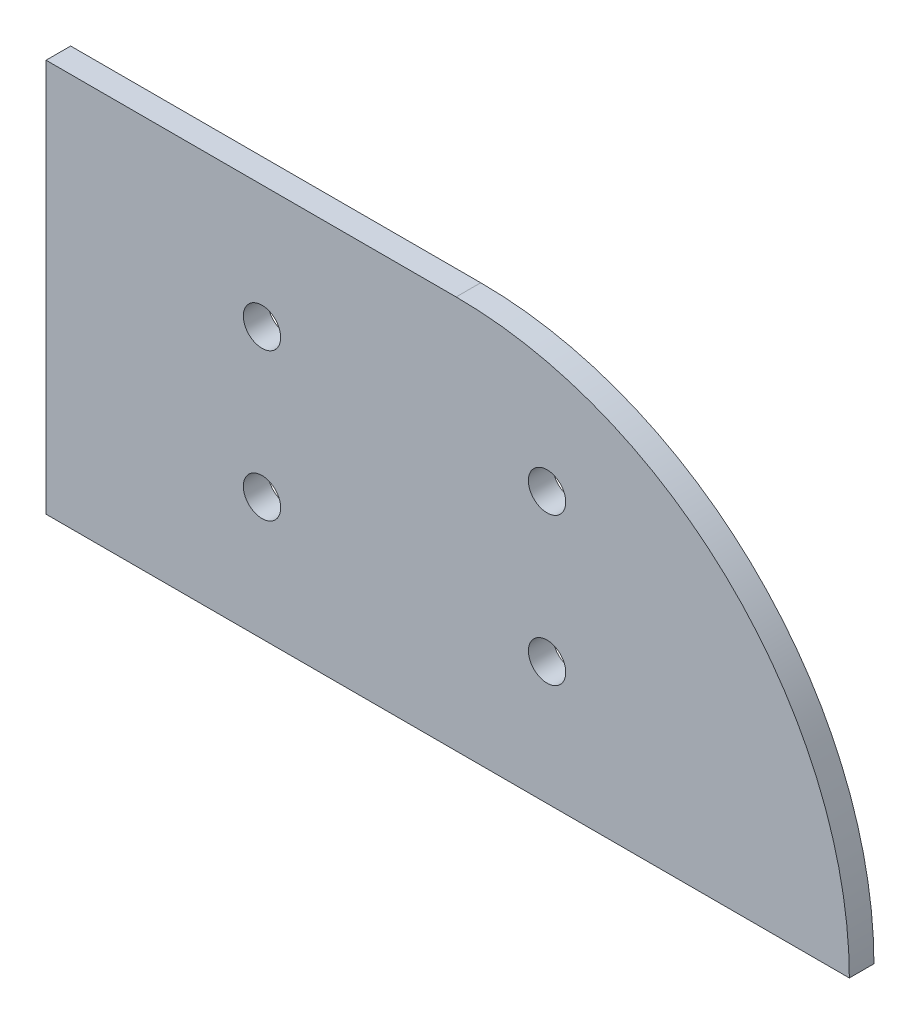
ISO-10303-21;
HEADER;
FILE_DESCRIPTION(('STEP AP214'),'2;1');
FILE_NAME('part.step','',(''),(''),'','','');
FILE_SCHEMA(('AUTOMOTIVE_DESIGN { 1 0 10303 214 1 1 1 1 }'));
ENDSEC;
DATA;
#1=APPLICATION_CONTEXT('core data for automotive mechanical design processes');
#2=APPLICATION_PROTOCOL_DEFINITION('international standard','automotive_design',2000,#1);
#3=PRODUCT_CONTEXT('',#1,'mechanical');
#4=PRODUCT('Part','Part','',(#3));
#5=PRODUCT_RELATED_PRODUCT_CATEGORY('part','',(#4));
#6=PRODUCT_DEFINITION_FORMATION('','',#4);
#7=PRODUCT_DEFINITION_CONTEXT('part definition',#1,'design');
#8=PRODUCT_DEFINITION('design','',#6,#7);
#9=PRODUCT_DEFINITION_SHAPE('','',#8);
#10=(LENGTH_UNIT() NAMED_UNIT(*) SI_UNIT(.MILLI.,.METRE.));
#11=(NAMED_UNIT(*) PLANE_ANGLE_UNIT() SI_UNIT($,.RADIAN.));
#12=(NAMED_UNIT(*) SI_UNIT($,.STERADIAN.) SOLID_ANGLE_UNIT());
#13=UNCERTAINTY_MEASURE_WITH_UNIT(LENGTH_MEASURE(1.E-05),#10,'distance_accuracy_value','');
#14=(GEOMETRIC_REPRESENTATION_CONTEXT(3) GLOBAL_UNCERTAINTY_ASSIGNED_CONTEXT((#13)) GLOBAL_UNIT_ASSIGNED_CONTEXT((#10,
#11,#12)) REPRESENTATION_CONTEXT('',''));
#15=CARTESIAN_POINT('',(0.,0.,0.));
#16=DIRECTION('',(0.,0.,1.));
#17=DIRECTION('',(1.,0.,0.));
#18=AXIS2_PLACEMENT_3D('',#15,#16,#17);
#19=CARTESIAN_POINT('',(52.9789755157234,0.,3.175));
#20=DIRECTION('',(0.,0.,-1.));
#21=DIRECTION('',(-1.,0.,0.));
#22=AXIS2_PLACEMENT_3D('',#19,#20,#21);
#23=CYLINDRICAL_SURFACE('',#22,50.8);
#24=CARTESIAN_POINT('',(52.9789755157234,0.,0.));
#25=DIRECTION('',(0.,0.,1.));
#26=DIRECTION('',(1.,0.,0.));
#27=AXIS2_PLACEMENT_3D('',#24,#25,#26);
#28=CIRCLE('',#27,50.8);
#29=CARTESIAN_POINT('',(103.778975515723,0.,0.));
#30=VERTEX_POINT('',#29);
#31=CARTESIAN_POINT('',(52.9789755157234,50.8,0.));
#32=VERTEX_POINT('',#31);
#33=EDGE_CURVE('E96',#30,#32,#28,.T.);
#34=ORIENTED_EDGE('',*,*,#33,.T.);
#35=DIRECTION('',(0.,0.,-1.));
#36=VECTOR('',#35,1.);
#37=CARTESIAN_POINT('',(52.9789755157234,50.8,3.175));
#38=LINE('',#37,#36);
#39=CARTESIAN_POINT('',(52.9789755157234,50.8,3.175));
#40=VERTEX_POINT('',#39);
#41=EDGE_CURVE('E11',#40,#32,#38,.T.);
#42=ORIENTED_EDGE('',*,*,#41,.F.);
#43=CARTESIAN_POINT('',(52.9789755157234,0.,3.175));
#44=DIRECTION('',(0.,0.,1.));
#45=DIRECTION('',(1.,0.,0.));
#46=AXIS2_PLACEMENT_3D('',#43,#44,#45);
#47=CIRCLE('',#46,50.8);
#48=CARTESIAN_POINT('',(103.778975515723,0.,3.175));
#49=VERTEX_POINT('',#48);
#50=EDGE_CURVE('E84',#49,#40,#47,.T.);
#51=ORIENTED_EDGE('',*,*,#50,.F.);
#52=DIRECTION('',(0.,0.,-1.));
#53=VECTOR('',#52,1.);
#54=CARTESIAN_POINT('',(103.778975515723,0.,3.175));
#55=LINE('',#54,#53);
#56=EDGE_CURVE('E92',#49,#30,#55,.T.);
#57=ORIENTED_EDGE('',*,*,#56,.T.);
#58=EDGE_LOOP('',(#34,#42,#51,#57));
#59=FACE_BOUND('',#58,.T.);
#60=ADVANCED_FACE('F33',(#59),#23,.T.);
#61=CARTESIAN_POINT('',(52.9789755157234,50.8,3.175));
#62=DIRECTION('',(0.,-1.,0.));
#63=DIRECTION('',(1.,0.,0.));
#64=AXIS2_PLACEMENT_3D('',#61,#62,#63);
#65=PLANE('',#64);
#66=DIRECTION('',(-1.,0.,0.));
#67=VECTOR('',#66,1.);
#68=CARTESIAN_POINT('',(52.9789755157234,50.8,0.));
#69=LINE('',#68,#67);
#70=CARTESIAN_POINT('',(0.,50.8,0.));
#71=VERTEX_POINT('',#70);
#72=EDGE_CURVE('E88',#32,#71,#69,.T.);
#73=ORIENTED_EDGE('',*,*,#72,.T.);
#74=DIRECTION('',(0.,0.,-1.));
#75=VECTOR('',#74,1.);
#76=CARTESIAN_POINT('',(0.,50.8,3.175));
#77=LINE('',#76,#75);
#78=CARTESIAN_POINT('',(0.,50.8,3.175));
#79=VERTEX_POINT('',#78);
#80=EDGE_CURVE('E41',#79,#71,#77,.T.);
#81=ORIENTED_EDGE('',*,*,#80,.F.);
#82=DIRECTION('',(-1.,0.,0.));
#83=VECTOR('',#82,1.);
#84=CARTESIAN_POINT('',(52.9789755157234,50.8,3.175));
#85=LINE('',#84,#83);
#86=EDGE_CURVE('E79',#40,#79,#85,.T.);
#87=ORIENTED_EDGE('',*,*,#86,.F.);
#88=ORIENTED_EDGE('',*,*,#41,.T.);
#89=EDGE_LOOP('',(#73,#81,#87,#88));
#90=FACE_BOUND('',#89,.T.);
#91=ADVANCED_FACE('F87',(#90),#65,.F.);
#92=CARTESIAN_POINT('',(0.,50.8,3.175));
#93=DIRECTION('',(1.,0.,0.));
#94=DIRECTION('',(0.,0.,-1.));
#95=AXIS2_PLACEMENT_3D('',#92,#93,#94);
#96=PLANE('',#95);
#97=DIRECTION('',(0.,-1.,0.));
#98=VECTOR('',#97,1.);
#99=CARTESIAN_POINT('',(0.,50.8,0.));
#100=LINE('',#99,#98);
#101=CARTESIAN_POINT('',(0.,0.,0.));
#102=VERTEX_POINT('',#101);
#103=EDGE_CURVE('E66',#71,#102,#100,.T.);
#104=ORIENTED_EDGE('',*,*,#103,.T.);
#105=DIRECTION('',(0.,0.,-1.));
#106=VECTOR('',#105,1.);
#107=CARTESIAN_POINT('',(0.,0.,3.175));
#108=LINE('',#107,#106);
#109=CARTESIAN_POINT('',(0.,0.,3.175));
#110=VERTEX_POINT('',#109);
#111=EDGE_CURVE('E89',#110,#102,#108,.T.);
#112=ORIENTED_EDGE('',*,*,#111,.F.);
#113=DIRECTION('',(0.,-1.,0.));
#114=VECTOR('',#113,1.);
#115=CARTESIAN_POINT('',(0.,50.8,3.175));
#116=LINE('',#115,#114);
#117=EDGE_CURVE('E82',#79,#110,#116,.T.);
#118=ORIENTED_EDGE('',*,*,#117,.F.);
#119=ORIENTED_EDGE('',*,*,#80,.T.);
#120=EDGE_LOOP('',(#104,#112,#118,#119));
#121=FACE_BOUND('',#120,.T.);
#122=ADVANCED_FACE('F90',(#121),#96,.F.);
#123=CARTESIAN_POINT('',(0.,0.,3.175));
#124=DIRECTION('',(0.,1.,0.));
#125=DIRECTION('',(0.,0.,1.));
#126=AXIS2_PLACEMENT_3D('',#123,#124,#125);
#127=PLANE('',#126);
#128=DIRECTION('',(1.,0.,0.));
#129=VECTOR('',#128,1.);
#130=CARTESIAN_POINT('',(0.,0.,0.));
#131=LINE('',#130,#129);
#132=EDGE_CURVE('E72',#102,#30,#131,.T.);
#133=ORIENTED_EDGE('',*,*,#132,.T.);
#134=ORIENTED_EDGE('',*,*,#56,.F.);
#135=DIRECTION('',(1.,0.,0.));
#136=VECTOR('',#135,1.);
#137=CARTESIAN_POINT('',(0.,0.,3.175));
#138=LINE('',#137,#136);
#139=EDGE_CURVE('E49',#110,#49,#138,.T.);
#140=ORIENTED_EDGE('',*,*,#139,.F.);
#141=ORIENTED_EDGE('',*,*,#111,.T.);
#142=EDGE_LOOP('',(#133,#134,#140,#141));
#143=FACE_BOUND('',#142,.T.);
#144=ADVANCED_FACE('F104',(#143),#127,.F.);
#145=CARTESIAN_POINT('',(52.9789755157234,0.,3.175));
#146=DIRECTION('',(0.,0.,1.));
#147=DIRECTION('',(1.,0.,0.));
#148=AXIS2_PLACEMENT_3D('',#145,#146,#147);
#149=PLANE('',#148);
#150=CARTESIAN_POINT('',(64.7264755157234,15.8749999999995,3.175));
#151=DIRECTION('',(0.,0.,1.));
#152=DIRECTION('',(1.,0.,0.));
#153=AXIS2_PLACEMENT_3D('',#150,#151,#152);
#154=CIRCLE('',#153,2.41300000000005);
#155=CARTESIAN_POINT('',(67.1394755157234,15.8749999999995,3.175));
#156=VERTEX_POINT('',#155);
#157=EDGE_CURVE('E99',#156,#156,#154,.T.);
#158=ORIENTED_EDGE('',*,*,#157,.F.);
#159=EDGE_LOOP('',(#158));
#160=FACE_BOUND('',#159,.T.);
#161=CARTESIAN_POINT('',(27.8964755157234,15.8749999999995,3.175));
#162=DIRECTION('',(0.,0.,1.));
#163=DIRECTION('',(1.,0.,0.));
#164=AXIS2_PLACEMENT_3D('',#161,#162,#163);
#165=CIRCLE('',#164,2.41300000000004);
#166=CARTESIAN_POINT('',(30.3094755157234,15.8749999999995,3.175));
#167=VERTEX_POINT('',#166);
#168=EDGE_CURVE('E112',#167,#167,#165,.T.);
#169=ORIENTED_EDGE('',*,*,#168,.F.);
#170=EDGE_LOOP('',(#169));
#171=FACE_BOUND('',#170,.T.);
#172=CARTESIAN_POINT('',(27.8964755157234,34.9249999999995,3.175));
#173=DIRECTION('',(0.,0.,1.));
#174=DIRECTION('',(1.,0.,0.));
#175=AXIS2_PLACEMENT_3D('',#172,#173,#174);
#176=CIRCLE('',#175,2.41300000000004);
#177=CARTESIAN_POINT('',(30.3094755157234,34.9249999999995,3.175));
#178=VERTEX_POINT('',#177);
#179=EDGE_CURVE('E115',#178,#178,#176,.T.);
#180=ORIENTED_EDGE('',*,*,#179,.F.);
#181=EDGE_LOOP('',(#180));
#182=FACE_BOUND('',#181,.T.);
#183=CARTESIAN_POINT('',(64.7264755157234,34.9249999999995,3.175));
#184=DIRECTION('',(0.,0.,1.));
#185=DIRECTION('',(1.,0.,0.));
#186=AXIS2_PLACEMENT_3D('',#183,#184,#185);
#187=CIRCLE('',#186,2.41300000000005);
#188=CARTESIAN_POINT('',(67.1394755157234,34.9249999999995,3.175));
#189=VERTEX_POINT('',#188);
#190=EDGE_CURVE('E118',#189,#189,#187,.T.);
#191=ORIENTED_EDGE('',*,*,#190,.F.);
#192=EDGE_LOOP('',(#191));
#193=FACE_BOUND('',#192,.T.);
#194=ORIENTED_EDGE('',*,*,#50,.T.);
#195=ORIENTED_EDGE('',*,*,#86,.T.);
#196=ORIENTED_EDGE('',*,*,#117,.T.);
#197=ORIENTED_EDGE('',*,*,#139,.T.);
#198=EDGE_LOOP('',(#194,#195,#196,#197));
#199=FACE_BOUND('',#198,.T.);
#200=ADVANCED_FACE('F80',(#160,#171,#182,#193,#199),#149,.T.);
#201=CARTESIAN_POINT('',(52.9789755157234,0.,0.));
#202=DIRECTION('',(0.,0.,1.));
#203=DIRECTION('',(1.,0.,0.));
#204=AXIS2_PLACEMENT_3D('',#201,#202,#203);
#205=PLANE('',#204);
#206=CARTESIAN_POINT('',(64.7264755157234,15.8749999999995,0.));
#207=DIRECTION('',(0.,0.,1.));
#208=DIRECTION('',(1.,0.,0.));
#209=AXIS2_PLACEMENT_3D('',#206,#207,#208);
#210=CIRCLE('',#209,2.41300000000005);
#211=CARTESIAN_POINT('',(67.1394755157234,15.8749999999995,0.));
#212=VERTEX_POINT('',#211);
#213=EDGE_CURVE('E125',#212,#212,#210,.T.);
#214=ORIENTED_EDGE('',*,*,#213,.T.);
#215=EDGE_LOOP('',(#214));
#216=FACE_BOUND('',#215,.T.);
#217=CARTESIAN_POINT('',(27.8964755157234,15.8749999999995,0.));
#218=DIRECTION('',(0.,0.,1.));
#219=DIRECTION('',(1.,0.,0.));
#220=AXIS2_PLACEMENT_3D('',#217,#218,#219);
#221=CIRCLE('',#220,2.41300000000004);
#222=CARTESIAN_POINT('',(30.3094755157234,15.8749999999995,0.));
#223=VERTEX_POINT('',#222);
#224=EDGE_CURVE('E128',#223,#223,#221,.T.);
#225=ORIENTED_EDGE('',*,*,#224,.T.);
#226=EDGE_LOOP('',(#225));
#227=FACE_BOUND('',#226,.T.);
#228=CARTESIAN_POINT('',(27.8964755157234,34.9249999999995,0.));
#229=DIRECTION('',(0.,0.,1.));
#230=DIRECTION('',(1.,0.,0.));
#231=AXIS2_PLACEMENT_3D('',#228,#229,#230);
#232=CIRCLE('',#231,2.41300000000004);
#233=CARTESIAN_POINT('',(30.3094755157234,34.9249999999995,0.));
#234=VERTEX_POINT('',#233);
#235=EDGE_CURVE('E124',#234,#234,#232,.T.);
#236=ORIENTED_EDGE('',*,*,#235,.T.);
#237=EDGE_LOOP('',(#236));
#238=FACE_BOUND('',#237,.T.);
#239=CARTESIAN_POINT('',(64.7264755157234,34.9249999999995,0.));
#240=DIRECTION('',(0.,0.,1.));
#241=DIRECTION('',(1.,0.,0.));
#242=AXIS2_PLACEMENT_3D('',#239,#240,#241);
#243=CIRCLE('',#242,2.41300000000005);
#244=CARTESIAN_POINT('',(67.1394755157234,34.9249999999995,0.));
#245=VERTEX_POINT('',#244);
#246=EDGE_CURVE('E121',#245,#245,#243,.T.);
#247=ORIENTED_EDGE('',*,*,#246,.T.);
#248=EDGE_LOOP('',(#247));
#249=FACE_BOUND('',#248,.T.);
#250=ORIENTED_EDGE('',*,*,#33,.F.);
#251=ORIENTED_EDGE('',*,*,#132,.F.);
#252=ORIENTED_EDGE('',*,*,#103,.F.);
#253=ORIENTED_EDGE('',*,*,#72,.F.);
#254=EDGE_LOOP('',(#250,#251,#252,#253));
#255=FACE_BOUND('',#254,.T.);
#256=ADVANCED_FACE('F107',(#216,#227,#238,#249,#255),#205,.F.);
#257=CARTESIAN_POINT('',(64.7264755157234,34.9249999999995,0.));
#258=DIRECTION('',(0.,0.,1.));
#259=DIRECTION('',(1.,0.,0.));
#260=AXIS2_PLACEMENT_3D('',#257,#258,#259);
#261=CYLINDRICAL_SURFACE('',#260,2.41300000000005);
#262=ORIENTED_EDGE('',*,*,#190,.T.);
#263=EDGE_LOOP('',(#262));
#264=FACE_BOUND('',#263,.T.);
#265=ORIENTED_EDGE('',*,*,#246,.F.);
#266=EDGE_LOOP('',(#265));
#267=FACE_BOUND('',#266,.T.);
#268=ADVANCED_FACE('F139',(#264,#267),#261,.F.);
#269=CARTESIAN_POINT('',(27.8964755157234,34.9249999999995,0.));
#270=DIRECTION('',(0.,0.,1.));
#271=DIRECTION('',(1.,0.,0.));
#272=AXIS2_PLACEMENT_3D('',#269,#270,#271);
#273=CYLINDRICAL_SURFACE('',#272,2.41300000000004);
#274=ORIENTED_EDGE('',*,*,#179,.T.);
#275=EDGE_LOOP('',(#274));
#276=FACE_BOUND('',#275,.T.);
#277=ORIENTED_EDGE('',*,*,#235,.F.);
#278=EDGE_LOOP('',(#277));
#279=FACE_BOUND('',#278,.T.);
#280=ADVANCED_FACE('F136',(#276,#279),#273,.F.);
#281=CARTESIAN_POINT('',(27.8964755157234,15.8749999999995,0.));
#282=DIRECTION('',(0.,0.,1.));
#283=DIRECTION('',(1.,0.,0.));
#284=AXIS2_PLACEMENT_3D('',#281,#282,#283);
#285=CYLINDRICAL_SURFACE('',#284,2.41300000000004);
#286=ORIENTED_EDGE('',*,*,#168,.T.);
#287=EDGE_LOOP('',(#286));
#288=FACE_BOUND('',#287,.T.);
#289=ORIENTED_EDGE('',*,*,#224,.F.);
#290=EDGE_LOOP('',(#289));
#291=FACE_BOUND('',#290,.T.);
#292=ADVANCED_FACE('F138',(#288,#291),#285,.F.);
#293=CARTESIAN_POINT('',(64.7264755157234,15.8749999999995,0.));
#294=DIRECTION('',(0.,0.,1.));
#295=DIRECTION('',(1.,0.,0.));
#296=AXIS2_PLACEMENT_3D('',#293,#294,#295);
#297=CYLINDRICAL_SURFACE('',#296,2.41300000000005);
#298=ORIENTED_EDGE('',*,*,#157,.T.);
#299=EDGE_LOOP('',(#298));
#300=FACE_BOUND('',#299,.T.);
#301=ORIENTED_EDGE('',*,*,#213,.F.);
#302=EDGE_LOOP('',(#301));
#303=FACE_BOUND('',#302,.T.);
#304=ADVANCED_FACE('F146',(#300,#303),#297,.F.);
#305=CLOSED_SHELL('',(#60,#91,#122,#144,#200,#256,#268,#280,#292,#304));
#306=MANIFOLD_SOLID_BREP('B2',#305);
#307=ADVANCED_BREP_SHAPE_REPRESENTATION('',(#18,#306),#14);
#308=SHAPE_DEFINITION_REPRESENTATION(#9,#307);
ENDSEC;
END-ISO-10303-21;
